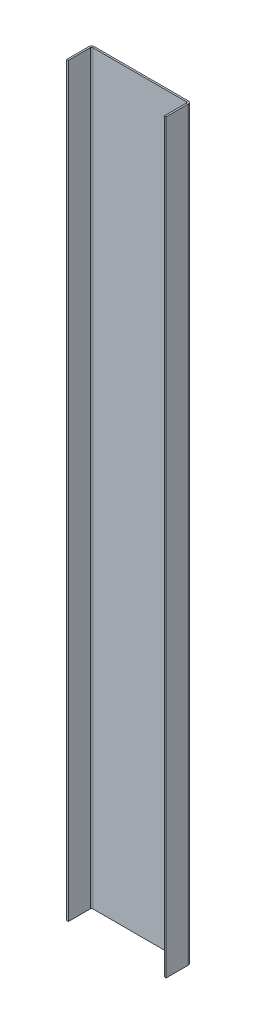
ISO-10303-21;
HEADER;
FILE_DESCRIPTION(('STEP AP214'),'2;1');
FILE_NAME('part.step','',(''),(''),'','','');
FILE_SCHEMA(('AUTOMOTIVE_DESIGN { 1 0 10303 214 1 1 1 1 }'));
ENDSEC;
DATA;
#1=APPLICATION_CONTEXT('core data for automotive mechanical design processes');
#2=APPLICATION_PROTOCOL_DEFINITION('international standard','automotive_design',2000,#1);
#3=PRODUCT_CONTEXT('',#1,'mechanical');
#4=PRODUCT('Part','Part','',(#3));
#5=PRODUCT_RELATED_PRODUCT_CATEGORY('part','',(#4));
#6=PRODUCT_DEFINITION_FORMATION('','',#4);
#7=PRODUCT_DEFINITION_CONTEXT('part definition',#1,'design');
#8=PRODUCT_DEFINITION('design','',#6,#7);
#9=PRODUCT_DEFINITION_SHAPE('','',#8);
#10=(LENGTH_UNIT() NAMED_UNIT(*) SI_UNIT(.MILLI.,.METRE.));
#11=(NAMED_UNIT(*) PLANE_ANGLE_UNIT() SI_UNIT($,.RADIAN.));
#12=(NAMED_UNIT(*) SI_UNIT($,.STERADIAN.) SOLID_ANGLE_UNIT());
#13=UNCERTAINTY_MEASURE_WITH_UNIT(LENGTH_MEASURE(1.E-05),#10,'distance_accuracy_value','');
#14=(GEOMETRIC_REPRESENTATION_CONTEXT(3) GLOBAL_UNCERTAINTY_ASSIGNED_CONTEXT((#13)) GLOBAL_UNIT_ASSIGNED_CONTEXT((#10,
#11,#12)) REPRESENTATION_CONTEXT('',''));
#15=CARTESIAN_POINT('',(0.,0.,0.));
#16=DIRECTION('',(0.,0.,1.));
#17=DIRECTION('',(1.,0.,0.));
#18=AXIS2_PLACEMENT_3D('',#15,#16,#17);
#19=CARTESIAN_POINT('',(0.,0.,-1.));
#20=DIRECTION('',(0.,0.,1.));
#21=DIRECTION('',(1.,0.,0.));
#22=AXIS2_PLACEMENT_3D('',#19,#20,#21);
#23=PLANE('',#22);
#24=DIRECTION('',(0.,-1.,0.));
#25=VECTOR('',#24,1.);
#26=CARTESIAN_POINT('',(-28.2633999999999,-225.,-1.00000000000002));
#27=LINE('',#26,#25);
#28=CARTESIAN_POINT('',(-28.2633999999999,-225.,-1.00000000000002));
#29=VERTEX_POINT('',#28);
#30=CARTESIAN_POINT('',(-28.2634,225.,-1.));
#31=VERTEX_POINT('',#30);
#32=EDGE_CURVE('E212',#29,#31,#27,.F.);
#33=ORIENTED_EDGE('',*,*,#32,.T.);
#34=DIRECTION('',(-1.,0.,0.));
#35=VECTOR('',#34,1.);
#36=CARTESIAN_POINT('',(-30.,225.,-1.));
#37=LINE('',#36,#35);
#38=CARTESIAN_POINT('',(28.2633999999999,225.,-1.00000000000002));
#39=VERTEX_POINT('',#38);
#40=EDGE_CURVE('E88',#39,#31,#37,.T.);
#41=ORIENTED_EDGE('',*,*,#40,.F.);
#42=DIRECTION('',(0.,1.,0.));
#43=VECTOR('',#42,1.);
#44=CARTESIAN_POINT('',(28.2633999999999,225.,-1.00000000000002));
#45=LINE('',#44,#43);
#46=CARTESIAN_POINT('',(28.2634,-225.,-1.));
#47=VERTEX_POINT('',#46);
#48=EDGE_CURVE('E265',#39,#47,#45,.F.);
#49=ORIENTED_EDGE('',*,*,#48,.T.);
#50=DIRECTION('',(1.,0.,0.));
#51=VECTOR('',#50,1.);
#52=CARTESIAN_POINT('',(-30.,-225.,-1.));
#53=LINE('',#52,#51);
#54=EDGE_CURVE('E13',#29,#47,#53,.T.);
#55=ORIENTED_EDGE('',*,*,#54,.F.);
#56=EDGE_LOOP('',(#33,#41,#49,#55));
#57=FACE_BOUND('',#56,.T.);
#58=ADVANCED_FACE('F79',(#57),#23,.F.);
#59=CARTESIAN_POINT('',(0.,0.,0.));
#60=DIRECTION('',(0.,0.,1.));
#61=DIRECTION('',(1.,0.,0.));
#62=AXIS2_PLACEMENT_3D('',#59,#60,#61);
#63=PLANE('',#62);
#64=DIRECTION('',(-1.,0.,0.));
#65=VECTOR('',#64,1.);
#66=CARTESIAN_POINT('',(-30.,225.,0.));
#67=LINE('',#66,#65);
#68=CARTESIAN_POINT('',(28.2634,225.,0.));
#69=VERTEX_POINT('',#68);
#70=CARTESIAN_POINT('',(-28.2634,225.,0.));
#71=VERTEX_POINT('',#70);
#72=EDGE_CURVE('E283',#69,#71,#67,.T.);
#73=ORIENTED_EDGE('',*,*,#72,.T.);
#74=DIRECTION('',(0.,-1.,0.));
#75=VECTOR('',#74,1.);
#76=CARTESIAN_POINT('',(-28.2634,-225.,0.));
#77=LINE('',#76,#75);
#78=CARTESIAN_POINT('',(-28.2634,-225.,0.));
#79=VERTEX_POINT('',#78);
#80=EDGE_CURVE('E224',#79,#71,#77,.F.);
#81=ORIENTED_EDGE('',*,*,#80,.F.);
#82=DIRECTION('',(1.,0.,0.));
#83=VECTOR('',#82,1.);
#84=CARTESIAN_POINT('',(-30.,-225.,0.));
#85=LINE('',#84,#83);
#86=CARTESIAN_POINT('',(28.2634,-225.,0.));
#87=VERTEX_POINT('',#86);
#88=EDGE_CURVE('E83',#79,#87,#85,.T.);
#89=ORIENTED_EDGE('',*,*,#88,.T.);
#90=DIRECTION('',(0.,1.,0.));
#91=VECTOR('',#90,1.);
#92=CARTESIAN_POINT('',(28.2634,225.,0.));
#93=LINE('',#92,#91);
#94=EDGE_CURVE('E96',#69,#87,#93,.F.);
#95=ORIENTED_EDGE('',*,*,#94,.F.);
#96=EDGE_LOOP('',(#73,#81,#89,#95));
#97=FACE_BOUND('',#96,.T.);
#98=ADVANCED_FACE('F288',(#97),#63,.T.);
#99=CARTESIAN_POINT('',(-30.,-225.,-1.));
#100=DIRECTION('',(0.,-1.,0.));
#101=DIRECTION('',(0.,0.,-1.));
#102=AXIS2_PLACEMENT_3D('',#99,#100,#101);
#103=PLANE('',#102);
#104=ORIENTED_EDGE('',*,*,#88,.F.);
#105=DIRECTION('',(0.,0.,-1.));
#106=VECTOR('',#105,1.);
#107=CARTESIAN_POINT('',(-28.2634,-225.,0.));
#108=LINE('',#107,#106);
#109=EDGE_CURVE('E218',#79,#29,#108,.T.);
#110=ORIENTED_EDGE('',*,*,#109,.T.);
#111=ORIENTED_EDGE('',*,*,#54,.T.);
#112=DIRECTION('',(0.,0.,-1.));
#113=VECTOR('',#112,1.);
#114=CARTESIAN_POINT('',(28.2634,-225.,0.));
#115=LINE('',#114,#113);
#116=EDGE_CURVE('E280',#87,#47,#115,.T.);
#117=ORIENTED_EDGE('',*,*,#116,.F.);
#118=EDGE_LOOP('',(#104,#110,#111,#117));
#119=FACE_BOUND('',#118,.T.);
#120=ADVANCED_FACE('F290',(#119),#103,.T.);
#121=CARTESIAN_POINT('',(-30.,225.,-1.));
#122=DIRECTION('',(0.,1.,0.));
#123=DIRECTION('',(0.,0.,1.));
#124=AXIS2_PLACEMENT_3D('',#121,#122,#123);
#125=PLANE('',#124);
#126=DIRECTION('',(0.,0.,-1.));
#127=VECTOR('',#126,1.);
#128=CARTESIAN_POINT('',(-28.2634,225.,0.));
#129=LINE('',#128,#127);
#130=EDGE_CURVE('E230',#71,#31,#129,.T.);
#131=ORIENTED_EDGE('',*,*,#130,.F.);
#132=ORIENTED_EDGE('',*,*,#72,.F.);
#133=DIRECTION('',(0.,0.,-1.));
#134=VECTOR('',#133,1.);
#135=CARTESIAN_POINT('',(28.2634,225.,0.));
#136=LINE('',#135,#134);
#137=EDGE_CURVE('E271',#69,#39,#136,.T.);
#138=ORIENTED_EDGE('',*,*,#137,.T.);
#139=ORIENTED_EDGE('',*,*,#40,.T.);
#140=EDGE_LOOP('',(#131,#132,#138,#139));
#141=FACE_BOUND('',#140,.T.);
#142=ADVANCED_FACE('F81',(#141),#125,.T.);
#143=CARTESIAN_POINT('',(28.2634,-225.,0.736600000000006));
#144=DIRECTION('',(0.,-1.,0.));
#145=DIRECTION('',(0.,0.,-1.));
#146=AXIS2_PLACEMENT_3D('',#143,#144,#145);
#147=PLANE('',#146);
#148=DIRECTION('',(-1.,0.,0.));
#149=VECTOR('',#148,1.);
#150=CARTESIAN_POINT('',(30.,-225.,0.736599999999993));
#151=LINE('',#150,#149);
#152=CARTESIAN_POINT('',(29.,-225.,0.736600000000004));
#153=VERTEX_POINT('',#152);
#154=CARTESIAN_POINT('',(30.,-225.,0.7366));
#155=VERTEX_POINT('',#154);
#156=EDGE_CURVE('E233',#153,#155,#151,.F.);
#157=ORIENTED_EDGE('',*,*,#156,.F.);
#158=CARTESIAN_POINT('',(28.2634,-225.,0.736600000000006));
#159=DIRECTION('',(0.,1.,0.));
#160=DIRECTION('',(0.,0.,1.));
#161=AXIS2_PLACEMENT_3D('',#158,#159,#160);
#162=CIRCLE('',#161,0.736600000000028);
#163=EDGE_CURVE('E274',#87,#153,#162,.F.);
#164=ORIENTED_EDGE('',*,*,#163,.F.);
#165=ORIENTED_EDGE('',*,*,#116,.T.);
#166=CARTESIAN_POINT('',(28.2634,-225.,0.736600000000006));
#167=DIRECTION('',(0.,1.,0.));
#168=DIRECTION('',(0.,0.,1.));
#169=AXIS2_PLACEMENT_3D('',#166,#167,#168);
#170=CIRCLE('',#169,1.73660000000003);
#171=EDGE_CURVE('E267',#47,#155,#170,.F.);
#172=ORIENTED_EDGE('',*,*,#171,.T.);
#173=EDGE_LOOP('',(#157,#164,#165,#172));
#174=FACE_BOUND('',#173,.T.);
#175=ADVANCED_FACE('F298',(#174),#147,.T.);
#176=CARTESIAN_POINT('',(28.2634,225.,0.736600000000006));
#177=DIRECTION('',(0.,-1.,0.));
#178=DIRECTION('',(0.,0.,-1.));
#179=AXIS2_PLACEMENT_3D('',#176,#177,#178);
#180=PLANE('',#179);
#181=CARTESIAN_POINT('',(28.2634,225.,0.736600000000006));
#182=DIRECTION('',(0.,1.,0.));
#183=DIRECTION('',(0.,0.,1.));
#184=AXIS2_PLACEMENT_3D('',#181,#182,#183);
#185=CIRCLE('',#184,0.736600000000028);
#186=CARTESIAN_POINT('',(29.,225.,0.736600000000004));
#187=VERTEX_POINT('',#186);
#188=EDGE_CURVE('E238',#187,#69,#185,.T.);
#189=ORIENTED_EDGE('',*,*,#188,.F.);
#190=DIRECTION('',(-1.,0.,0.));
#191=VECTOR('',#190,1.);
#192=CARTESIAN_POINT('',(29.,225.,0.736600000000011));
#193=LINE('',#192,#191);
#194=CARTESIAN_POINT('',(30.,225.,0.736600000000007));
#195=VERTEX_POINT('',#194);
#196=EDGE_CURVE('E258',#187,#195,#193,.F.);
#197=ORIENTED_EDGE('',*,*,#196,.T.);
#198=CARTESIAN_POINT('',(28.2634,225.,0.736600000000006));
#199=DIRECTION('',(0.,1.,0.));
#200=DIRECTION('',(0.,0.,1.));
#201=AXIS2_PLACEMENT_3D('',#198,#199,#200);
#202=CIRCLE('',#201,1.73660000000003);
#203=EDGE_CURVE('E268',#195,#39,#202,.T.);
#204=ORIENTED_EDGE('',*,*,#203,.T.);
#205=ORIENTED_EDGE('',*,*,#137,.F.);
#206=EDGE_LOOP('',(#189,#197,#204,#205));
#207=FACE_BOUND('',#206,.T.);
#208=ADVANCED_FACE('F319',(#207),#180,.F.);
#209=CARTESIAN_POINT('',(28.2634,225.,0.736600000000006));
#210=DIRECTION('',(0.,1.,0.));
#211=DIRECTION('',(1.,0.,0.));
#212=AXIS2_PLACEMENT_3D('',#209,#210,#211);
#213=CYLINDRICAL_SURFACE('',#212,1.73660000000003);
#214=ORIENTED_EDGE('',*,*,#48,.F.);
#215=ORIENTED_EDGE('',*,*,#203,.F.);
#216=DIRECTION('',(0.,1.,0.));
#217=VECTOR('',#216,1.);
#218=CARTESIAN_POINT('',(30.,-225.,0.736599999999993));
#219=LINE('',#218,#217);
#220=EDGE_CURVE('E256',#195,#155,#219,.F.);
#221=ORIENTED_EDGE('',*,*,#220,.T.);
#222=ORIENTED_EDGE('',*,*,#171,.F.);
#223=EDGE_LOOP('',(#214,#215,#221,#222));
#224=FACE_BOUND('',#223,.T.);
#225=ADVANCED_FACE('F329',(#224),#213,.T.);
#226=CARTESIAN_POINT('',(28.2634,225.,0.736600000000006));
#227=DIRECTION('',(0.,1.,0.));
#228=DIRECTION('',(1.,0.,0.));
#229=AXIS2_PLACEMENT_3D('',#226,#227,#228);
#230=CYLINDRICAL_SURFACE('',#229,0.736600000000028);
#231=ORIENTED_EDGE('',*,*,#94,.T.);
#232=ORIENTED_EDGE('',*,*,#163,.T.);
#233=DIRECTION('',(0.,1.,0.));
#234=VECTOR('',#233,1.);
#235=CARTESIAN_POINT('',(29.,-225.,0.736599999999997));
#236=LINE('',#235,#234);
#237=EDGE_CURVE('E261',#153,#187,#236,.T.);
#238=ORIENTED_EDGE('',*,*,#237,.T.);
#239=ORIENTED_EDGE('',*,*,#188,.T.);
#240=EDGE_LOOP('',(#231,#232,#238,#239));
#241=FACE_BOUND('',#240,.T.);
#242=ADVANCED_FACE('F295',(#241),#230,.F.);
#243=CARTESIAN_POINT('',(30.,225.,14.));
#244=DIRECTION('',(0.,-1.,0.));
#245=DIRECTION('',(1.,0.,0.));
#246=AXIS2_PLACEMENT_3D('',#243,#244,#245);
#247=PLANE('',#246);
#248=ORIENTED_EDGE('',*,*,#196,.F.);
#249=DIRECTION('',(0.,0.,-1.));
#250=VECTOR('',#249,1.);
#251=CARTESIAN_POINT('',(29.,225.,14.));
#252=LINE('',#251,#250);
#253=CARTESIAN_POINT('',(29.,225.,14.));
#254=VERTEX_POINT('',#253);
#255=EDGE_CURVE('E254',#187,#254,#252,.F.);
#256=ORIENTED_EDGE('',*,*,#255,.T.);
#257=DIRECTION('',(-1.,0.,0.));
#258=VECTOR('',#257,1.);
#259=CARTESIAN_POINT('',(30.,225.,14.));
#260=LINE('',#259,#258);
#261=CARTESIAN_POINT('',(30.,225.,14.));
#262=VERTEX_POINT('',#261);
#263=EDGE_CURVE('E235',#262,#254,#260,.T.);
#264=ORIENTED_EDGE('',*,*,#263,.F.);
#265=DIRECTION('',(0.,0.,1.));
#266=VECTOR('',#265,1.);
#267=CARTESIAN_POINT('',(30.,225.,-1.07574889897451E-13));
#268=LINE('',#267,#266);
#269=EDGE_CURVE('E247',#195,#262,#268,.T.);
#270=ORIENTED_EDGE('',*,*,#269,.F.);
#271=EDGE_LOOP('',(#248,#256,#264,#270));
#272=FACE_BOUND('',#271,.T.);
#273=ADVANCED_FACE('F321',(#272),#247,.F.);
#274=CARTESIAN_POINT('',(30.,-225.,0.));
#275=DIRECTION('',(0.,1.,0.));
#276=DIRECTION('',(-1.,0.,0.));
#277=AXIS2_PLACEMENT_3D('',#274,#275,#276);
#278=PLANE('',#277);
#279=ORIENTED_EDGE('',*,*,#156,.T.);
#280=DIRECTION('',(0.,0.,-1.));
#281=VECTOR('',#280,1.);
#282=CARTESIAN_POINT('',(30.,-225.,-1.07574889897452E-13));
#283=LINE('',#282,#281);
#284=CARTESIAN_POINT('',(30.0000000000001,-225.,14.));
#285=VERTEX_POINT('',#284);
#286=EDGE_CURVE('E242',#285,#155,#283,.T.);
#287=ORIENTED_EDGE('',*,*,#286,.F.);
#288=DIRECTION('',(-1.,0.,0.));
#289=VECTOR('',#288,1.);
#290=CARTESIAN_POINT('',(30.0000000000001,-225.,14.));
#291=LINE('',#290,#289);
#292=CARTESIAN_POINT('',(29.0000000000001,-225.,14.));
#293=VERTEX_POINT('',#292);
#294=EDGE_CURVE('E239',#285,#293,#291,.T.);
#295=ORIENTED_EDGE('',*,*,#294,.T.);
#296=DIRECTION('',(0.,0.,1.));
#297=VECTOR('',#296,1.);
#298=CARTESIAN_POINT('',(29.,-225.,0.));
#299=LINE('',#298,#297);
#300=EDGE_CURVE('E249',#293,#153,#299,.F.);
#301=ORIENTED_EDGE('',*,*,#300,.T.);
#302=EDGE_LOOP('',(#279,#287,#295,#301));
#303=FACE_BOUND('',#302,.T.);
#304=ADVANCED_FACE('F301',(#303),#278,.F.);
#305=CARTESIAN_POINT('',(30.,0.,-1.07574889897452E-13));
#306=DIRECTION('',(-1.,0.,0.));
#307=DIRECTION('',(0.,0.,1.));
#308=AXIS2_PLACEMENT_3D('',#305,#306,#307);
#309=PLANE('',#308);
#310=ORIENTED_EDGE('',*,*,#220,.F.);
#311=ORIENTED_EDGE('',*,*,#269,.T.);
#312=DIRECTION('',(0.,-1.,0.));
#313=VECTOR('',#312,1.);
#314=CARTESIAN_POINT('',(30.,0.,14.));
#315=LINE('',#314,#313);
#316=EDGE_CURVE('E245',#262,#285,#315,.T.);
#317=ORIENTED_EDGE('',*,*,#316,.T.);
#318=ORIENTED_EDGE('',*,*,#286,.T.);
#319=EDGE_LOOP('',(#310,#311,#317,#318));
#320=FACE_BOUND('',#319,.T.);
#321=ADVANCED_FACE('F305',(#320),#309,.F.);
#322=CARTESIAN_POINT('',(29.,0.,-1.04083408558608E-13));
#323=DIRECTION('',(-1.,0.,0.));
#324=DIRECTION('',(0.,0.,1.));
#325=AXIS2_PLACEMENT_3D('',#322,#323,#324);
#326=PLANE('',#325);
#327=ORIENTED_EDGE('',*,*,#255,.F.);
#328=ORIENTED_EDGE('',*,*,#237,.F.);
#329=ORIENTED_EDGE('',*,*,#300,.F.);
#330=DIRECTION('',(0.,1.,0.));
#331=VECTOR('',#330,1.);
#332=CARTESIAN_POINT('',(29.0000000000001,-225.,14.));
#333=LINE('',#332,#331);
#334=EDGE_CURVE('E252',#254,#293,#333,.F.);
#335=ORIENTED_EDGE('',*,*,#334,.F.);
#336=EDGE_LOOP('',(#327,#328,#329,#335));
#337=FACE_BOUND('',#336,.T.);
#338=ADVANCED_FACE('F315',(#337),#326,.T.);
#339=CARTESIAN_POINT('',(30.0000000000001,-225.,14.));
#340=DIRECTION('',(0.,0.,-1.));
#341=DIRECTION('',(-1.,0.,0.));
#342=AXIS2_PLACEMENT_3D('',#339,#340,#341);
#343=PLANE('',#342);
#344=ORIENTED_EDGE('',*,*,#334,.T.);
#345=ORIENTED_EDGE('',*,*,#294,.F.);
#346=ORIENTED_EDGE('',*,*,#316,.F.);
#347=ORIENTED_EDGE('',*,*,#263,.T.);
#348=EDGE_LOOP('',(#344,#345,#346,#347));
#349=FACE_BOUND('',#348,.T.);
#350=ADVANCED_FACE('F311',(#349),#343,.F.);
#351=CARTESIAN_POINT('',(-28.2634,225.,0.736600000000005));
#352=DIRECTION('',(0.,1.,0.));
#353=DIRECTION('',(0.,0.,1.));
#354=AXIS2_PLACEMENT_3D('',#351,#352,#353);
#355=PLANE('',#354);
#356=DIRECTION('',(1.,0.,0.));
#357=VECTOR('',#356,1.);
#358=CARTESIAN_POINT('',(-30.,225.,0.736599999999993));
#359=LINE('',#358,#357);
#360=CARTESIAN_POINT('',(-29.,225.,0.736600000000002));
#361=VERTEX_POINT('',#360);
#362=CARTESIAN_POINT('',(-30.,225.,0.736599999999999));
#363=VERTEX_POINT('',#362);
#364=EDGE_CURVE('E194',#361,#363,#359,.F.);
#365=ORIENTED_EDGE('',*,*,#364,.F.);
#366=CARTESIAN_POINT('',(-28.2634,225.,0.736600000000005));
#367=DIRECTION('',(0.,-1.,0.));
#368=DIRECTION('',(0.,0.,-1.));
#369=AXIS2_PLACEMENT_3D('',#366,#367,#368);
#370=CIRCLE('',#369,0.736600000000028);
#371=EDGE_CURVE('E221',#71,#361,#370,.F.);
#372=ORIENTED_EDGE('',*,*,#371,.F.);
#373=ORIENTED_EDGE('',*,*,#130,.T.);
#374=CARTESIAN_POINT('',(-28.2634,225.,0.736600000000005));
#375=DIRECTION('',(0.,-1.,0.));
#376=DIRECTION('',(0.,0.,-1.));
#377=AXIS2_PLACEMENT_3D('',#374,#375,#376);
#378=CIRCLE('',#377,1.73660000000003);
#379=EDGE_CURVE('E214',#31,#363,#378,.F.);
#380=ORIENTED_EDGE('',*,*,#379,.T.);
#381=EDGE_LOOP('',(#365,#372,#373,#380));
#382=FACE_BOUND('',#381,.T.);
#383=ADVANCED_FACE('F353',(#382),#355,.T.);
#384=CARTESIAN_POINT('',(-28.2634,-225.,0.736600000000005));
#385=DIRECTION('',(0.,1.,0.));
#386=DIRECTION('',(0.,0.,1.));
#387=AXIS2_PLACEMENT_3D('',#384,#385,#386);
#388=PLANE('',#387);
#389=CARTESIAN_POINT('',(-28.2634,-225.,0.736600000000005));
#390=DIRECTION('',(0.,-1.,0.));
#391=DIRECTION('',(0.,0.,-1.));
#392=AXIS2_PLACEMENT_3D('',#389,#390,#391);
#393=CIRCLE('',#392,0.736600000000028);
#394=CARTESIAN_POINT('',(-29.,-225.,0.736600000000002));
#395=VERTEX_POINT('',#394);
#396=EDGE_CURVE('E227',#395,#79,#393,.T.);
#397=ORIENTED_EDGE('',*,*,#396,.F.);
#398=DIRECTION('',(1.,0.,0.));
#399=VECTOR('',#398,1.);
#400=CARTESIAN_POINT('',(-29.,-225.,0.736600000000007));
#401=LINE('',#400,#399);
#402=CARTESIAN_POINT('',(-30.,-225.,0.736600000000004));
#403=VERTEX_POINT('',#402);
#404=EDGE_CURVE('E206',#395,#403,#401,.F.);
#405=ORIENTED_EDGE('',*,*,#404,.T.);
#406=CARTESIAN_POINT('',(-28.2634,-225.,0.736600000000005));
#407=DIRECTION('',(0.,-1.,0.));
#408=DIRECTION('',(0.,0.,-1.));
#409=AXIS2_PLACEMENT_3D('',#406,#407,#408);
#410=CIRCLE('',#409,1.73660000000003);
#411=EDGE_CURVE('E215',#403,#29,#410,.T.);
#412=ORIENTED_EDGE('',*,*,#411,.T.);
#413=ORIENTED_EDGE('',*,*,#109,.F.);
#414=EDGE_LOOP('',(#397,#405,#412,#413));
#415=FACE_BOUND('',#414,.T.);
#416=ADVANCED_FACE('F368',(#415),#388,.F.);
#417=CARTESIAN_POINT('',(-28.2634,-225.,0.736600000000005));
#418=DIRECTION('',(0.,-1.,0.));
#419=DIRECTION('',(-1.,0.,0.));
#420=AXIS2_PLACEMENT_3D('',#417,#418,#419);
#421=CYLINDRICAL_SURFACE('',#420,1.73660000000003);
#422=ORIENTED_EDGE('',*,*,#32,.F.);
#423=ORIENTED_EDGE('',*,*,#411,.F.);
#424=DIRECTION('',(0.,-1.,0.));
#425=VECTOR('',#424,1.);
#426=CARTESIAN_POINT('',(-30.,225.,0.736599999999993));
#427=LINE('',#426,#425);
#428=EDGE_CURVE('E204',#403,#363,#427,.F.);
#429=ORIENTED_EDGE('',*,*,#428,.T.);
#430=ORIENTED_EDGE('',*,*,#379,.F.);
#431=EDGE_LOOP('',(#422,#423,#429,#430));
#432=FACE_BOUND('',#431,.T.);
#433=ADVANCED_FACE('F356',(#432),#421,.T.);
#434=CARTESIAN_POINT('',(-28.2634,-225.,0.736600000000005));
#435=DIRECTION('',(0.,-1.,0.));
#436=DIRECTION('',(-1.,0.,0.));
#437=AXIS2_PLACEMENT_3D('',#434,#435,#436);
#438=CYLINDRICAL_SURFACE('',#437,0.736600000000028);
#439=ORIENTED_EDGE('',*,*,#80,.T.);
#440=ORIENTED_EDGE('',*,*,#371,.T.);
#441=DIRECTION('',(0.,-1.,0.));
#442=VECTOR('',#441,1.);
#443=CARTESIAN_POINT('',(-29.,225.,0.736599999999997));
#444=LINE('',#443,#442);
#445=EDGE_CURVE('E209',#361,#395,#444,.T.);
#446=ORIENTED_EDGE('',*,*,#445,.T.);
#447=ORIENTED_EDGE('',*,*,#396,.T.);
#448=EDGE_LOOP('',(#439,#440,#446,#447));
#449=FACE_BOUND('',#448,.T.);
#450=ADVANCED_FACE('F366',(#449),#438,.F.);
#451=CARTESIAN_POINT('',(-30.,-225.,14.));
#452=DIRECTION('',(0.,1.,0.));
#453=DIRECTION('',(0.,0.,1.));
#454=AXIS2_PLACEMENT_3D('',#451,#452,#453);
#455=PLANE('',#454);
#456=ORIENTED_EDGE('',*,*,#404,.F.);
#457=DIRECTION('',(0.,0.,-1.));
#458=VECTOR('',#457,1.);
#459=CARTESIAN_POINT('',(-29.,-225.,14.));
#460=LINE('',#459,#458);
#461=CARTESIAN_POINT('',(-29.,-225.,14.));
#462=VERTEX_POINT('',#461);
#463=EDGE_CURVE('E202',#395,#462,#460,.F.);
#464=ORIENTED_EDGE('',*,*,#463,.T.);
#465=DIRECTION('',(1.,0.,0.));
#466=VECTOR('',#465,1.);
#467=CARTESIAN_POINT('',(-30.,-225.,14.));
#468=LINE('',#467,#466);
#469=CARTESIAN_POINT('',(-30.,-225.,14.));
#470=VERTEX_POINT('',#469);
#471=EDGE_CURVE('E190',#470,#462,#468,.T.);
#472=ORIENTED_EDGE('',*,*,#471,.F.);
#473=DIRECTION('',(0.,0.,1.));
#474=VECTOR('',#473,1.);
#475=CARTESIAN_POINT('',(-30.,-225.,7.84568612033478E-13));
#476=LINE('',#475,#474);
#477=EDGE_CURVE('E177',#403,#470,#476,.T.);
#478=ORIENTED_EDGE('',*,*,#477,.F.);
#479=EDGE_LOOP('',(#456,#464,#472,#478));
#480=FACE_BOUND('',#479,.T.);
#481=ADVANCED_FACE('F359',(#480),#455,.F.);
#482=CARTESIAN_POINT('',(-30.,225.,0.));
#483=DIRECTION('',(0.,-1.,0.));
#484=DIRECTION('',(1.,0.,0.));
#485=AXIS2_PLACEMENT_3D('',#482,#483,#484);
#486=PLANE('',#485);
#487=ORIENTED_EDGE('',*,*,#364,.T.);
#488=DIRECTION('',(0.,0.,-1.));
#489=VECTOR('',#488,1.);
#490=CARTESIAN_POINT('',(-30.,225.,-1.07574889897452E-13));
#491=LINE('',#490,#489);
#492=CARTESIAN_POINT('',(-30.0000000000001,225.,14.));
#493=VERTEX_POINT('',#492);
#494=EDGE_CURVE('E175',#493,#363,#491,.T.);
#495=ORIENTED_EDGE('',*,*,#494,.F.);
#496=DIRECTION('',(1.,0.,0.));
#497=VECTOR('',#496,1.);
#498=CARTESIAN_POINT('',(-30.0000000000001,225.,14.));
#499=LINE('',#498,#497);
#500=CARTESIAN_POINT('',(-29.0000000000001,225.,14.));
#501=VERTEX_POINT('',#500);
#502=EDGE_CURVE('E183',#493,#501,#499,.T.);
#503=ORIENTED_EDGE('',*,*,#502,.T.);
#504=DIRECTION('',(0.,0.,1.));
#505=VECTOR('',#504,1.);
#506=CARTESIAN_POINT('',(-29.,225.,0.));
#507=LINE('',#506,#505);
#508=EDGE_CURVE('E199',#501,#361,#507,.F.);
#509=ORIENTED_EDGE('',*,*,#508,.T.);
#510=EDGE_LOOP('',(#487,#495,#503,#509));
#511=FACE_BOUND('',#510,.T.);
#512=ADVANCED_FACE('F193',(#511),#486,.F.);
#513=CARTESIAN_POINT('',(-30.,0.,-1.07574889897452E-13));
#514=DIRECTION('',(1.,0.,0.));
#515=DIRECTION('',(0.,0.,-1.));
#516=AXIS2_PLACEMENT_3D('',#513,#514,#515);
#517=PLANE('',#516);
#518=ORIENTED_EDGE('',*,*,#428,.F.);
#519=ORIENTED_EDGE('',*,*,#477,.T.);
#520=DIRECTION('',(0.,1.,0.));
#521=VECTOR('',#520,1.);
#522=CARTESIAN_POINT('',(-30.0000000000001,0.,14.));
#523=LINE('',#522,#521);
#524=EDGE_CURVE('E170',#470,#493,#523,.T.);
#525=ORIENTED_EDGE('',*,*,#524,.T.);
#526=ORIENTED_EDGE('',*,*,#494,.T.);
#527=EDGE_LOOP('',(#518,#519,#525,#526));
#528=FACE_BOUND('',#527,.T.);
#529=ADVANCED_FACE('F173',(#528),#517,.F.);
#530=CARTESIAN_POINT('',(-29.,0.,-1.04083408558608E-13));
#531=DIRECTION('',(1.,0.,0.));
#532=DIRECTION('',(0.,0.,-1.));
#533=AXIS2_PLACEMENT_3D('',#530,#531,#532);
#534=PLANE('',#533);
#535=ORIENTED_EDGE('',*,*,#463,.F.);
#536=ORIENTED_EDGE('',*,*,#445,.F.);
#537=ORIENTED_EDGE('',*,*,#508,.F.);
#538=DIRECTION('',(0.,-1.,0.));
#539=VECTOR('',#538,1.);
#540=CARTESIAN_POINT('',(-29.0000000000001,225.,14.));
#541=LINE('',#540,#539);
#542=EDGE_CURVE('E186',#462,#501,#541,.F.);
#543=ORIENTED_EDGE('',*,*,#542,.F.);
#544=EDGE_LOOP('',(#535,#536,#537,#543));
#545=FACE_BOUND('',#544,.T.);
#546=ADVANCED_FACE('F362',(#545),#534,.T.);
#547=CARTESIAN_POINT('',(-30.0000000000001,225.,14.));
#548=DIRECTION('',(0.,0.,-1.));
#549=DIRECTION('',(-1.,0.,0.));
#550=AXIS2_PLACEMENT_3D('',#547,#548,#549);
#551=PLANE('',#550);
#552=ORIENTED_EDGE('',*,*,#542,.T.);
#553=ORIENTED_EDGE('',*,*,#502,.F.);
#554=ORIENTED_EDGE('',*,*,#524,.F.);
#555=ORIENTED_EDGE('',*,*,#471,.T.);
#556=EDGE_LOOP('',(#552,#553,#554,#555));
#557=FACE_BOUND('',#556,.T.);
#558=ADVANCED_FACE('F184',(#557),#551,.F.);
#559=CLOSED_SHELL('',(#58,#98,#120,#142,#175,#208,#225,#242,#273,#304,#321,#338,#350,#383,#416,
#433,#450,#481,#512,#529,#546,#558));
#560=MANIFOLD_SOLID_BREP('B2',#559);
#561=ADVANCED_BREP_SHAPE_REPRESENTATION('',(#18,#560),#14);
#562=SHAPE_DEFINITION_REPRESENTATION(#9,#561);
ENDSEC;
END-ISO-10303-21;
